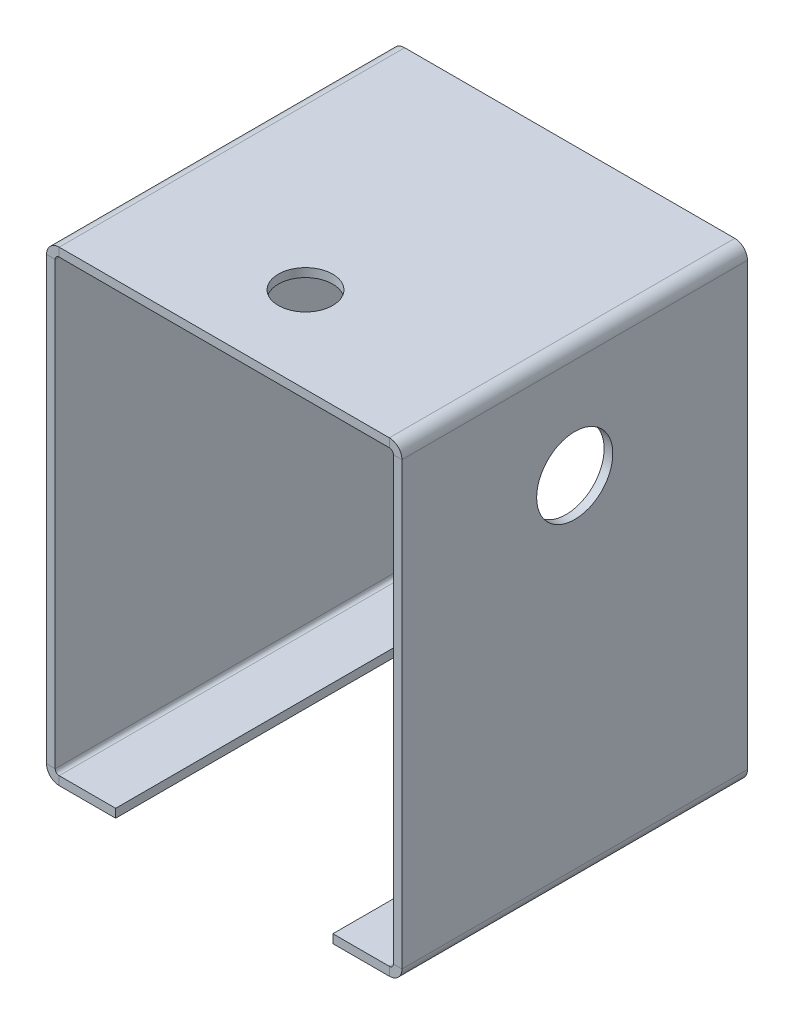
ISO-10303-21;
HEADER;
FILE_DESCRIPTION(('STEP AP214'),'2;1');
FILE_NAME('part.step','',(''),(''),'','','');
FILE_SCHEMA(('AUTOMOTIVE_DESIGN { 1 0 10303 214 1 1 1 1 }'));
ENDSEC;
DATA;
#1=APPLICATION_CONTEXT('core data for automotive mechanical design processes');
#2=APPLICATION_PROTOCOL_DEFINITION('international standard','automotive_design',2000,#1);
#3=PRODUCT_CONTEXT('',#1,'mechanical');
#4=PRODUCT('Part','Part','',(#3));
#5=PRODUCT_RELATED_PRODUCT_CATEGORY('part','',(#4));
#6=PRODUCT_DEFINITION_FORMATION('','',#4);
#7=PRODUCT_DEFINITION_CONTEXT('part definition',#1,'design');
#8=PRODUCT_DEFINITION('design','',#6,#7);
#9=PRODUCT_DEFINITION_SHAPE('','',#8);
#10=(LENGTH_UNIT() NAMED_UNIT(*) SI_UNIT(.MILLI.,.METRE.));
#11=(NAMED_UNIT(*) PLANE_ANGLE_UNIT() SI_UNIT($,.RADIAN.));
#12=(NAMED_UNIT(*) SI_UNIT($,.STERADIAN.) SOLID_ANGLE_UNIT());
#13=UNCERTAINTY_MEASURE_WITH_UNIT(LENGTH_MEASURE(1.E-05),#10,'distance_accuracy_value','');
#14=(GEOMETRIC_REPRESENTATION_CONTEXT(3) GLOBAL_UNCERTAINTY_ASSIGNED_CONTEXT((#13)) GLOBAL_UNIT_ASSIGNED_CONTEXT((#10,
#11,#12)) REPRESENTATION_CONTEXT('',''));
#15=CARTESIAN_POINT('',(0.,0.,0.));
#16=DIRECTION('',(0.,0.,1.));
#17=DIRECTION('',(1.,0.,0.));
#18=AXIS2_PLACEMENT_3D('',#15,#16,#17);
#19=CARTESIAN_POINT('',(-63.7499999440006,2.19380097704199E-13,0.));
#20=DIRECTION('',(0.,0.,1.));
#21=DIRECTION('',(1.,0.,0.));
#22=AXIS2_PLACEMENT_3D('',#19,#20,#21);
#23=PLANE('',#22);
#24=DIRECTION('',(-1.,0.,0.));
#25=VECTOR('',#24,1.);
#26=CARTESIAN_POINT('',(-62.1624999440006,0.736600000000206,0.));
#27=LINE('',#26,#25);
#28=CARTESIAN_POINT('',(-62.1624999440006,0.736600000000201,0.));
#29=VERTEX_POINT('',#28);
#30=CARTESIAN_POINT('',(-63.7499999440006,0.736600000000207,0.));
#31=VERTEX_POINT('',#30);
#32=EDGE_CURVE('E235',#29,#31,#27,.T.);
#33=ORIENTED_EDGE('',*,*,#32,.T.);
#34=DIRECTION('',(0.,-1.,0.));
#35=VECTOR('',#34,1.);
#36=CARTESIAN_POINT('',(-63.7499999440006,2.19380097704199E-13,0.));
#37=LINE('',#36,#35);
#38=CARTESIAN_POINT('',(-63.749999944,81.8134000000002,0.));
#39=VERTEX_POINT('',#38);
#40=EDGE_CURVE('E258',#39,#31,#37,.T.);
#41=ORIENTED_EDGE('',*,*,#40,.F.);
#42=DIRECTION('',(-1.,0.,0.));
#43=VECTOR('',#42,1.);
#44=CARTESIAN_POINT('',(-62.162499944,81.8134000000002,0.));
#45=LINE('',#44,#43);
#46=CARTESIAN_POINT('',(-62.162499944,81.8134000000002,0.));
#47=VERTEX_POINT('',#46);
#48=EDGE_CURVE('E249',#47,#39,#45,.T.);
#49=ORIENTED_EDGE('',*,*,#48,.F.);
#50=DIRECTION('',(0.,-1.,0.));
#51=VECTOR('',#50,1.);
#52=CARTESIAN_POINT('',(-62.1624999440006,2.08166817117217E-13,0.));
#53=LINE('',#52,#51);
#54=EDGE_CURVE('E257',#47,#29,#53,.T.);
#55=ORIENTED_EDGE('',*,*,#54,.T.);
#56=EDGE_LOOP('',(#33,#41,#49,#55));
#57=FACE_BOUND('',#56,.T.);
#58=ADVANCED_FACE('F38',(#57),#23,.F.);
#59=CARTESIAN_POINT('',(-63.749999944,82.5500000000002,63.5));
#60=DIRECTION('',(0.,0.,-1.));
#61=DIRECTION('',(-1.,0.,0.));
#62=AXIS2_PLACEMENT_3D('',#59,#60,#61);
#63=PLANE('',#62);
#64=DIRECTION('',(-1.,0.,0.));
#65=VECTOR('',#64,1.);
#66=CARTESIAN_POINT('',(-62.1624999440006,0.736600000000197,63.5));
#67=LINE('',#66,#65);
#68=CARTESIAN_POINT('',(-62.1624999440006,0.736600000000197,63.5));
#69=VERTEX_POINT('',#68);
#70=CARTESIAN_POINT('',(-63.7499999440006,0.736600000000208,63.5));
#71=VERTEX_POINT('',#70);
#72=EDGE_CURVE('E241',#69,#71,#67,.T.);
#73=ORIENTED_EDGE('',*,*,#72,.F.);
#74=DIRECTION('',(0.,1.,0.));
#75=VECTOR('',#74,1.);
#76=CARTESIAN_POINT('',(-62.162499944,82.5500000000002,63.5));
#77=LINE('',#76,#75);
#78=CARTESIAN_POINT('',(-62.162499944,81.8134000000002,63.5));
#79=VERTEX_POINT('',#78);
#80=EDGE_CURVE('E261',#69,#79,#77,.T.);
#81=ORIENTED_EDGE('',*,*,#80,.T.);
#82=DIRECTION('',(-1.,0.,0.));
#83=VECTOR('',#82,1.);
#84=CARTESIAN_POINT('',(-62.162499944,81.8134000000002,63.5));
#85=LINE('',#84,#83);
#86=CARTESIAN_POINT('',(-63.749999944,81.8134000000002,63.5));
#87=VERTEX_POINT('',#86);
#88=EDGE_CURVE('E244',#79,#87,#85,.T.);
#89=ORIENTED_EDGE('',*,*,#88,.T.);
#90=DIRECTION('',(0.,1.,0.));
#91=VECTOR('',#90,1.);
#92=CARTESIAN_POINT('',(-63.749999944,82.5500000000002,63.5));
#93=LINE('',#92,#91);
#94=EDGE_CURVE('E260',#71,#87,#93,.T.);
#95=ORIENTED_EDGE('',*,*,#94,.F.);
#96=EDGE_LOOP('',(#73,#81,#89,#95));
#97=FACE_BOUND('',#96,.T.);
#98=ADVANCED_FACE('F457',(#97),#63,.F.);
#99=CARTESIAN_POINT('',(-63.7499999440006,4.50128790225952E-13,0.));
#100=DIRECTION('',(1.,0.,0.));
#101=DIRECTION('',(0.,1.,0.));
#102=AXIS2_PLACEMENT_3D('',#99,#100,#101);
#103=PLANE('',#102);
#104=CARTESIAN_POINT('',(-63.7499999440002,63.4125000000004,31.75));
#105=DIRECTION('',(1.,0.,0.));
#106=DIRECTION('',(0.,1.,0.));
#107=AXIS2_PLACEMENT_3D('',#104,#105,#106);
#108=CIRCLE('',#107,5.);
#109=CARTESIAN_POINT('',(-63.7499999440001,68.4125000000004,31.75));
#110=VERTEX_POINT('',#109);
#111=EDGE_CURVE('E437',#110,#110,#108,.T.);
#112=ORIENTED_EDGE('',*,*,#111,.T.);
#113=EDGE_LOOP('',(#112));
#114=FACE_BOUND('',#113,.T.);
#115=DIRECTION('',(0.,0.,-1.));
#116=VECTOR('',#115,1.);
#117=CARTESIAN_POINT('',(-63.7499999440006,0.736600000000207,0.));
#118=LINE('',#117,#116);
#119=EDGE_CURVE('E188',#31,#71,#118,.F.);
#120=ORIENTED_EDGE('',*,*,#119,.T.);
#121=ORIENTED_EDGE('',*,*,#94,.T.);
#122=DIRECTION('',(0.,0.,1.));
#123=VECTOR('',#122,1.);
#124=CARTESIAN_POINT('',(-63.749999944,81.8134000000002,0.));
#125=LINE('',#124,#123);
#126=EDGE_CURVE('E252',#39,#87,#125,.T.);
#127=ORIENTED_EDGE('',*,*,#126,.F.);
#128=ORIENTED_EDGE('',*,*,#40,.T.);
#129=EDGE_LOOP('',(#120,#121,#127,#128));
#130=FACE_BOUND('',#129,.T.);
#131=ADVANCED_FACE('F449',(#114,#130),#103,.F.);
#132=CARTESIAN_POINT('',(-62.1624999440006,4.3891550963897E-13,0.));
#133=DIRECTION('',(1.,0.,0.));
#134=DIRECTION('',(0.,1.,0.));
#135=AXIS2_PLACEMENT_3D('',#132,#133,#134);
#136=PLANE('',#135);
#137=CARTESIAN_POINT('',(-62.1624999440001,63.4125000000004,31.75));
#138=DIRECTION('',(1.,0.,0.));
#139=DIRECTION('',(0.,1.,0.));
#140=AXIS2_PLACEMENT_3D('',#137,#138,#139);
#141=CIRCLE('',#140,5.);
#142=CARTESIAN_POINT('',(-62.1624999440001,68.4125000000004,31.75));
#143=VERTEX_POINT('',#142);
#144=EDGE_CURVE('E440',#143,#143,#141,.T.);
#145=ORIENTED_EDGE('',*,*,#144,.F.);
#146=EDGE_LOOP('',(#145));
#147=FACE_BOUND('',#146,.T.);
#148=ORIENTED_EDGE('',*,*,#80,.F.);
#149=DIRECTION('',(0.,0.,-1.));
#150=VECTOR('',#149,1.);
#151=CARTESIAN_POINT('',(-62.1624999440006,0.736600000000206,0.));
#152=LINE('',#151,#150);
#153=EDGE_CURVE('E55',#29,#69,#152,.F.);
#154=ORIENTED_EDGE('',*,*,#153,.F.);
#155=ORIENTED_EDGE('',*,*,#54,.F.);
#156=DIRECTION('',(0.,0.,-1.));
#157=VECTOR('',#156,1.);
#158=CARTESIAN_POINT('',(-62.162499944,81.8134000000002,63.5));
#159=LINE('',#158,#157);
#160=EDGE_CURVE('E247',#79,#47,#159,.T.);
#161=ORIENTED_EDGE('',*,*,#160,.F.);
#162=EDGE_LOOP('',(#148,#154,#155,#161));
#163=FACE_BOUND('',#162,.T.);
#164=ADVANCED_FACE('F421',(#147,#163),#136,.T.);
#165=CARTESIAN_POINT('',(0.,84.1375,63.5));
#166=DIRECTION('',(0.,0.,-1.));
#167=DIRECTION('',(-1.,0.,0.));
#168=AXIS2_PLACEMENT_3D('',#165,#166,#167);
#169=PLANE('',#168);
#170=DIRECTION('',(0.,1.,0.));
#171=VECTOR('',#170,1.);
#172=CARTESIAN_POINT('',(-61.425899944,82.5500000000002,63.5));
#173=LINE('',#172,#171);
#174=CARTESIAN_POINT('',(-61.425899944,82.5500000000002,63.5));
#175=VERTEX_POINT('',#174);
#176=CARTESIAN_POINT('',(-61.425899944,84.1375000000002,63.5));
#177=VERTEX_POINT('',#176);
#178=EDGE_CURVE('E281',#175,#177,#173,.T.);
#179=ORIENTED_EDGE('',*,*,#178,.F.);
#180=DIRECTION('',(1.,0.,0.));
#181=VECTOR('',#180,1.);
#182=CARTESIAN_POINT('',(0.,82.55,63.5));
#183=LINE('',#182,#181);
#184=CARTESIAN_POINT('',(-0.736600000000004,82.55,63.5));
#185=VERTEX_POINT('',#184);
#186=EDGE_CURVE('E297',#175,#185,#183,.T.);
#187=ORIENTED_EDGE('',*,*,#186,.T.);
#188=DIRECTION('',(0.,1.,0.));
#189=VECTOR('',#188,1.);
#190=CARTESIAN_POINT('',(-0.736600000000004,82.55,63.5));
#191=LINE('',#190,#189);
#192=CARTESIAN_POINT('',(-0.736599999999998,84.1375,63.5));
#193=VERTEX_POINT('',#192);
#194=EDGE_CURVE('E284',#185,#193,#191,.T.);
#195=ORIENTED_EDGE('',*,*,#194,.T.);
#196=DIRECTION('',(1.,0.,0.));
#197=VECTOR('',#196,1.);
#198=CARTESIAN_POINT('',(0.,84.1375,63.5));
#199=LINE('',#198,#197);
#200=EDGE_CURVE('E298',#177,#193,#199,.T.);
#201=ORIENTED_EDGE('',*,*,#200,.F.);
#202=EDGE_LOOP('',(#179,#187,#195,#201));
#203=FACE_BOUND('',#202,.T.);
#204=ADVANCED_FACE('F448',(#203),#169,.F.);
#205=CARTESIAN_POINT('',(-62.162499944,84.1375000000002,0.));
#206=DIRECTION('',(0.,0.,1.));
#207=DIRECTION('',(1.,0.,0.));
#208=AXIS2_PLACEMENT_3D('',#205,#206,#207);
#209=PLANE('',#208);
#210=DIRECTION('',(0.,1.,0.));
#211=VECTOR('',#210,1.);
#212=CARTESIAN_POINT('',(-61.425899944,82.5500000000002,0.));
#213=LINE('',#212,#211);
#214=CARTESIAN_POINT('',(-61.425899944,82.5500000000002,0.));
#215=VERTEX_POINT('',#214);
#216=CARTESIAN_POINT('',(-61.425899944,84.1375000000002,0.));
#217=VERTEX_POINT('',#216);
#218=EDGE_CURVE('E272',#215,#217,#213,.T.);
#219=ORIENTED_EDGE('',*,*,#218,.T.);
#220=DIRECTION('',(-1.,0.,0.));
#221=VECTOR('',#220,1.);
#222=CARTESIAN_POINT('',(-62.162499944,84.1375000000002,0.));
#223=LINE('',#222,#221);
#224=CARTESIAN_POINT('',(-0.736599999999998,84.1375,0.));
#225=VERTEX_POINT('',#224);
#226=EDGE_CURVE('E300',#225,#217,#223,.T.);
#227=ORIENTED_EDGE('',*,*,#226,.F.);
#228=DIRECTION('',(0.,1.,0.));
#229=VECTOR('',#228,1.);
#230=CARTESIAN_POINT('',(-0.736600000000004,82.55,0.));
#231=LINE('',#230,#229);
#232=CARTESIAN_POINT('',(-0.736600000000004,82.55,0.));
#233=VERTEX_POINT('',#232);
#234=EDGE_CURVE('E289',#233,#225,#231,.T.);
#235=ORIENTED_EDGE('',*,*,#234,.F.);
#236=DIRECTION('',(-1.,0.,0.));
#237=VECTOR('',#236,1.);
#238=CARTESIAN_POINT('',(-62.162499944,82.5500000000002,0.));
#239=LINE('',#238,#237);
#240=EDGE_CURVE('E301',#233,#215,#239,.T.);
#241=ORIENTED_EDGE('',*,*,#240,.T.);
#242=EDGE_LOOP('',(#219,#227,#235,#241));
#243=FACE_BOUND('',#242,.T.);
#244=ADVANCED_FACE('F410',(#243),#209,.F.);
#245=CARTESIAN_POINT('',(3.00411532627006E-13,84.1375,0.));
#246=DIRECTION('',(0.,-1.,0.));
#247=DIRECTION('',(1.,0.,0.));
#248=AXIS2_PLACEMENT_3D('',#245,#246,#247);
#249=PLANE('',#248);
#250=CARTESIAN_POINT('',(-32.,84.1375000000001,47.64999995));
#251=DIRECTION('',(0.,1.,0.));
#252=DIRECTION('',(-1.,0.,0.));
#253=AXIS2_PLACEMENT_3D('',#250,#251,#252);
#254=CIRCLE('',#253,5.);
#255=CARTESIAN_POINT('',(-37.,84.1375000000001,47.64999995));
#256=VERTEX_POINT('',#255);
#257=EDGE_CURVE('E434',#256,#256,#254,.T.);
#258=ORIENTED_EDGE('',*,*,#257,.F.);
#259=EDGE_LOOP('',(#258));
#260=FACE_BOUND('',#259,.T.);
#261=DIRECTION('',(0.,0.,-1.));
#262=VECTOR('',#261,1.);
#263=CARTESIAN_POINT('',(-61.425899944,84.1375000000002,0.));
#264=LINE('',#263,#262);
#265=EDGE_CURVE('E266',#217,#177,#264,.F.);
#266=ORIENTED_EDGE('',*,*,#265,.T.);
#267=ORIENTED_EDGE('',*,*,#200,.T.);
#268=DIRECTION('',(0.,0.,1.));
#269=VECTOR('',#268,1.);
#270=CARTESIAN_POINT('',(-0.736599999999998,84.1375,0.));
#271=LINE('',#270,#269);
#272=EDGE_CURVE('E292',#225,#193,#271,.T.);
#273=ORIENTED_EDGE('',*,*,#272,.F.);
#274=ORIENTED_EDGE('',*,*,#226,.T.);
#275=EDGE_LOOP('',(#266,#267,#273,#274));
#276=FACE_BOUND('',#275,.T.);
#277=ADVANCED_FACE('F481',(#260,#276),#249,.F.);
#278=CARTESIAN_POINT('',(2.94868806001592E-13,82.55,0.));
#279=DIRECTION('',(0.,-1.,0.));
#280=DIRECTION('',(1.,0.,0.));
#281=AXIS2_PLACEMENT_3D('',#278,#279,#280);
#282=PLANE('',#281);
#283=CARTESIAN_POINT('',(-32.,82.5500000000001,47.64999995));
#284=DIRECTION('',(0.,-1.,0.));
#285=DIRECTION('',(1.,0.,0.));
#286=AXIS2_PLACEMENT_3D('',#283,#284,#285);
#287=CIRCLE('',#286,5.);
#288=CARTESIAN_POINT('',(-27.,82.5500000000001,47.64999995));
#289=VERTEX_POINT('',#288);
#290=EDGE_CURVE('E42',#289,#289,#287,.T.);
#291=ORIENTED_EDGE('',*,*,#290,.F.);
#292=EDGE_LOOP('',(#291));
#293=FACE_BOUND('',#292,.T.);
#294=ORIENTED_EDGE('',*,*,#186,.F.);
#295=DIRECTION('',(0.,0.,-1.));
#296=VECTOR('',#295,1.);
#297=CARTESIAN_POINT('',(-61.425899944,82.5500000000002,0.));
#298=LINE('',#297,#296);
#299=EDGE_CURVE('E63',#215,#175,#298,.F.);
#300=ORIENTED_EDGE('',*,*,#299,.F.);
#301=ORIENTED_EDGE('',*,*,#240,.F.);
#302=DIRECTION('',(0.,0.,-1.));
#303=VECTOR('',#302,1.);
#304=CARTESIAN_POINT('',(-0.736600000000004,82.55,63.5));
#305=LINE('',#304,#303);
#306=EDGE_CURVE('E287',#185,#233,#305,.T.);
#307=ORIENTED_EDGE('',*,*,#306,.F.);
#308=EDGE_LOOP('',(#294,#300,#301,#307));
#309=FACE_BOUND('',#308,.T.);
#310=ADVANCED_FACE('F407',(#293,#309),#282,.T.);
#311=CARTESIAN_POINT('',(1.5875,0.,63.5));
#312=DIRECTION('',(-1.,0.,0.));
#313=DIRECTION('',(0.,0.,1.));
#314=AXIS2_PLACEMENT_3D('',#311,#312,#313);
#315=PLANE('',#314);
#316=CARTESIAN_POINT('',(1.5875,63.4125,31.75));
#317=DIRECTION('',(-1.,0.,0.));
#318=DIRECTION('',(0.,0.,1.));
#319=AXIS2_PLACEMENT_3D('',#316,#317,#318);
#320=CIRCLE('',#319,7.);
#321=CARTESIAN_POINT('',(1.5875,63.4125,38.75));
#322=VERTEX_POINT('',#321);
#323=EDGE_CURVE('E329',#322,#322,#320,.T.);
#324=ORIENTED_EDGE('',*,*,#323,.T.);
#325=EDGE_LOOP('',(#324));
#326=FACE_BOUND('',#325,.T.);
#327=DIRECTION('',(0.,0.,-1.));
#328=VECTOR('',#327,1.);
#329=CARTESIAN_POINT('',(1.5875,81.8134,0.));
#330=LINE('',#329,#328);
#331=CARTESIAN_POINT('',(1.5875,81.8134,0.));
#332=VERTEX_POINT('',#331);
#333=CARTESIAN_POINT('',(1.5875,81.8134,63.5));
#334=VERTEX_POINT('',#333);
#335=EDGE_CURVE('E306',#332,#334,#330,.F.);
#336=ORIENTED_EDGE('',*,*,#335,.T.);
#337=DIRECTION('',(0.,1.,0.));
#338=VECTOR('',#337,1.);
#339=CARTESIAN_POINT('',(1.5875,0.,63.5));
#340=LINE('',#339,#338);
#341=CARTESIAN_POINT('',(1.5875,0.736599999999993,63.5));
#342=VERTEX_POINT('',#341);
#343=EDGE_CURVE('E47',#342,#334,#340,.T.);
#344=ORIENTED_EDGE('',*,*,#343,.F.);
#345=DIRECTION('',(0.,0.,1.));
#346=VECTOR('',#345,1.);
#347=CARTESIAN_POINT('',(1.5875,0.736599999999993,63.5));
#348=LINE('',#347,#346);
#349=CARTESIAN_POINT('',(1.5875,0.736599999999993,0.));
#350=VERTEX_POINT('',#349);
#351=EDGE_CURVE('E365',#342,#350,#348,.F.);
#352=ORIENTED_EDGE('',*,*,#351,.T.);
#353=DIRECTION('',(0.,1.,0.));
#354=VECTOR('',#353,1.);
#355=CARTESIAN_POINT('',(1.5875,0.,0.));
#356=LINE('',#355,#354);
#357=EDGE_CURVE('E386',#350,#332,#356,.T.);
#358=ORIENTED_EDGE('',*,*,#357,.T.);
#359=EDGE_LOOP('',(#336,#344,#352,#358));
#360=FACE_BOUND('',#359,.T.);
#361=ADVANCED_FACE('F40',(#326,#360),#315,.F.);
#362=CARTESIAN_POINT('',(0.,0.,63.5));
#363=DIRECTION('',(-1.,0.,0.));
#364=DIRECTION('',(0.,0.,1.));
#365=AXIS2_PLACEMENT_3D('',#362,#363,#364);
#366=PLANE('',#365);
#367=CARTESIAN_POINT('',(0.,63.4125,31.75));
#368=DIRECTION('',(-1.,0.,0.));
#369=DIRECTION('',(0.,0.,1.));
#370=AXIS2_PLACEMENT_3D('',#367,#368,#369);
#371=CIRCLE('',#370,7.);
#372=CARTESIAN_POINT('',(0.,63.4125,38.75));
#373=VERTEX_POINT('',#372);
#374=EDGE_CURVE('E326',#373,#373,#371,.T.);
#375=ORIENTED_EDGE('',*,*,#374,.F.);
#376=EDGE_LOOP('',(#375));
#377=FACE_BOUND('',#376,.T.);
#378=DIRECTION('',(0.,1.,0.));
#379=VECTOR('',#378,1.);
#380=CARTESIAN_POINT('',(0.,0.,63.5));
#381=LINE('',#380,#379);
#382=CARTESIAN_POINT('',(0.,0.736599999999997,63.5));
#383=VERTEX_POINT('',#382);
#384=CARTESIAN_POINT('',(0.,81.8134,63.5));
#385=VERTEX_POINT('',#384);
#386=EDGE_CURVE('E11',#383,#385,#381,.T.);
#387=ORIENTED_EDGE('',*,*,#386,.T.);
#388=DIRECTION('',(0.,0.,-1.));
#389=VECTOR('',#388,1.);
#390=CARTESIAN_POINT('',(0.,81.8134,0.));
#391=LINE('',#390,#389);
#392=CARTESIAN_POINT('',(0.,81.8134,0.));
#393=VERTEX_POINT('',#392);
#394=EDGE_CURVE('E318',#393,#385,#391,.F.);
#395=ORIENTED_EDGE('',*,*,#394,.F.);
#396=DIRECTION('',(0.,1.,0.));
#397=VECTOR('',#396,1.);
#398=CARTESIAN_POINT('',(0.,0.,0.));
#399=LINE('',#398,#397);
#400=CARTESIAN_POINT('',(0.,0.736599999999993,0.));
#401=VERTEX_POINT('',#400);
#402=EDGE_CURVE('E390',#401,#393,#399,.T.);
#403=ORIENTED_EDGE('',*,*,#402,.F.);
#404=DIRECTION('',(0.,0.,1.));
#405=VECTOR('',#404,1.);
#406=CARTESIAN_POINT('',(0.,0.736599999999997,63.5));
#407=LINE('',#406,#405);
#408=EDGE_CURVE('E378',#383,#401,#407,.F.);
#409=ORIENTED_EDGE('',*,*,#408,.F.);
#410=EDGE_LOOP('',(#387,#395,#403,#409));
#411=FACE_BOUND('',#410,.T.);
#412=ADVANCED_FACE('F545',(#377,#411),#366,.T.);
#413=CARTESIAN_POINT('',(0.,0.,63.5));
#414=DIRECTION('',(0.,0.,-1.));
#415=DIRECTION('',(-1.,0.,0.));
#416=AXIS2_PLACEMENT_3D('',#413,#414,#415);
#417=PLANE('',#416);
#418=DIRECTION('',(1.,0.,0.));
#419=VECTOR('',#418,1.);
#420=CARTESIAN_POINT('',(0.,81.8134,63.5));
#421=LINE('',#420,#419);
#422=EDGE_CURVE('E323',#385,#334,#421,.T.);
#423=ORIENTED_EDGE('',*,*,#422,.F.);
#424=ORIENTED_EDGE('',*,*,#386,.F.);
#425=DIRECTION('',(1.,0.,0.));
#426=VECTOR('',#425,1.);
#427=CARTESIAN_POINT('',(0.,0.736599999999997,63.5));
#428=LINE('',#427,#426);
#429=EDGE_CURVE('E372',#383,#342,#428,.T.);
#430=ORIENTED_EDGE('',*,*,#429,.T.);
#431=ORIENTED_EDGE('',*,*,#343,.T.);
#432=EDGE_LOOP('',(#423,#424,#430,#431));
#433=FACE_BOUND('',#432,.T.);
#434=ADVANCED_FACE('F542',(#433),#417,.F.);
#435=CARTESIAN_POINT('',(0.,0.,0.));
#436=DIRECTION('',(0.,0.,-1.));
#437=DIRECTION('',(-1.,0.,0.));
#438=AXIS2_PLACEMENT_3D('',#435,#436,#437);
#439=PLANE('',#438);
#440=ORIENTED_EDGE('',*,*,#402,.T.);
#441=DIRECTION('',(1.,0.,0.));
#442=VECTOR('',#441,1.);
#443=CARTESIAN_POINT('',(0.,81.8134,0.));
#444=LINE('',#443,#442);
#445=EDGE_CURVE('E312',#393,#332,#444,.T.);
#446=ORIENTED_EDGE('',*,*,#445,.T.);
#447=ORIENTED_EDGE('',*,*,#357,.F.);
#448=DIRECTION('',(1.,0.,0.));
#449=VECTOR('',#448,1.);
#450=CARTESIAN_POINT('',(0.,0.736599999999993,0.));
#451=LINE('',#450,#449);
#452=EDGE_CURVE('E383',#401,#350,#451,.T.);
#453=ORIENTED_EDGE('',*,*,#452,.F.);
#454=EDGE_LOOP('',(#440,#446,#447,#453));
#455=FACE_BOUND('',#454,.T.);
#456=ADVANCED_FACE('F396',(#455),#439,.T.);
#457=CARTESIAN_POINT('',(-0.7366,0.736599999999995,0.));
#458=DIRECTION('',(0.,0.,-1.));
#459=DIRECTION('',(0.,1.,0.));
#460=AXIS2_PLACEMENT_3D('',#457,#458,#459);
#461=PLANE('',#460);
#462=DIRECTION('',(0.,-1.,0.));
#463=VECTOR('',#462,1.);
#464=CARTESIAN_POINT('',(-0.736599999999997,0.,0.));
#465=LINE('',#464,#463);
#466=CARTESIAN_POINT('',(-0.736599999999997,0.,0.));
#467=VERTEX_POINT('',#466);
#468=CARTESIAN_POINT('',(-0.736599999999992,-1.5875,0.));
#469=VERTEX_POINT('',#468);
#470=EDGE_CURVE('E332',#467,#469,#465,.T.);
#471=ORIENTED_EDGE('',*,*,#470,.F.);
#472=CARTESIAN_POINT('',(-0.7366,0.736599999999995,0.));
#473=DIRECTION('',(0.,0.,1.));
#474=DIRECTION('',(0.,-1.,0.));
#475=AXIS2_PLACEMENT_3D('',#472,#473,#474);
#476=CIRCLE('',#475,0.736599999999998);
#477=EDGE_CURVE('E375',#401,#467,#476,.F.);
#478=ORIENTED_EDGE('',*,*,#477,.F.);
#479=ORIENTED_EDGE('',*,*,#452,.T.);
#480=CARTESIAN_POINT('',(-0.7366,0.736599999999995,0.));
#481=DIRECTION('',(0.,0.,1.));
#482=DIRECTION('',(0.,-1.,0.));
#483=AXIS2_PLACEMENT_3D('',#480,#481,#482);
#484=CIRCLE('',#483,2.3241);
#485=EDGE_CURVE('E368',#350,#469,#484,.F.);
#486=ORIENTED_EDGE('',*,*,#485,.T.);
#487=EDGE_LOOP('',(#471,#478,#479,#486));
#488=FACE_BOUND('',#487,.T.);
#489=ADVANCED_FACE('F535',(#488),#461,.T.);
#490=CARTESIAN_POINT('',(-0.7366,0.7366,63.5));
#491=DIRECTION('',(0.,0.,-1.));
#492=DIRECTION('',(0.,1.,0.));
#493=AXIS2_PLACEMENT_3D('',#490,#491,#492);
#494=PLANE('',#493);
#495=CARTESIAN_POINT('',(-0.7366,0.7366,63.5));
#496=DIRECTION('',(0.,0.,1.));
#497=DIRECTION('',(0.,-1.,0.));
#498=AXIS2_PLACEMENT_3D('',#495,#496,#497);
#499=CIRCLE('',#498,0.736599999999998);
#500=CARTESIAN_POINT('',(-0.736599999999997,0.,63.5));
#501=VERTEX_POINT('',#500);
#502=EDGE_CURVE('E364',#501,#383,#499,.T.);
#503=ORIENTED_EDGE('',*,*,#502,.F.);
#504=DIRECTION('',(0.,-1.,0.));
#505=VECTOR('',#504,1.);
#506=CARTESIAN_POINT('',(-0.736599999999997,0.,63.5));
#507=LINE('',#506,#505);
#508=CARTESIAN_POINT('',(-0.736599999999992,-1.5875,63.5));
#509=VERTEX_POINT('',#508);
#510=EDGE_CURVE('E337',#501,#509,#507,.T.);
#511=ORIENTED_EDGE('',*,*,#510,.T.);
#512=CARTESIAN_POINT('',(-0.7366,0.7366,63.5));
#513=DIRECTION('',(0.,0.,1.));
#514=DIRECTION('',(0.,-1.,0.));
#515=AXIS2_PLACEMENT_3D('',#512,#513,#514);
#516=CIRCLE('',#515,2.3241);
#517=EDGE_CURVE('E369',#509,#342,#516,.T.);
#518=ORIENTED_EDGE('',*,*,#517,.T.);
#519=ORIENTED_EDGE('',*,*,#429,.F.);
#520=EDGE_LOOP('',(#503,#511,#518,#519));
#521=FACE_BOUND('',#520,.T.);
#522=ADVANCED_FACE('F530',(#521),#494,.F.);
#523=CARTESIAN_POINT('',(-0.7366,0.7366,63.5));
#524=DIRECTION('',(0.,0.,1.));
#525=DIRECTION('',(0.,-1.,0.));
#526=AXIS2_PLACEMENT_3D('',#523,#524,#525);
#527=CYLINDRICAL_SURFACE('',#526,2.3241);
#528=ORIENTED_EDGE('',*,*,#351,.F.);
#529=ORIENTED_EDGE('',*,*,#517,.F.);
#530=DIRECTION('',(0.,0.,-1.));
#531=VECTOR('',#530,1.);
#532=CARTESIAN_POINT('',(-0.736599999999992,-1.5875,0.));
#533=LINE('',#532,#531);
#534=EDGE_CURVE('E340',#509,#469,#533,.T.);
#535=ORIENTED_EDGE('',*,*,#534,.T.);
#536=ORIENTED_EDGE('',*,*,#485,.F.);
#537=EDGE_LOOP('',(#528,#529,#535,#536));
#538=FACE_BOUND('',#537,.T.);
#539=ADVANCED_FACE('F527',(#538),#527,.T.);
#540=CARTESIAN_POINT('',(-0.7366,0.7366,63.5));
#541=DIRECTION('',(0.,0.,1.));
#542=DIRECTION('',(0.,-1.,0.));
#543=AXIS2_PLACEMENT_3D('',#540,#541,#542);
#544=CYLINDRICAL_SURFACE('',#543,0.736599999999998);
#545=ORIENTED_EDGE('',*,*,#408,.T.);
#546=ORIENTED_EDGE('',*,*,#477,.T.);
#547=DIRECTION('',(0.,0.,1.));
#548=VECTOR('',#547,1.);
#549=CARTESIAN_POINT('',(-0.736599999999997,0.,0.));
#550=LINE('',#549,#548);
#551=EDGE_CURVE('E335',#467,#501,#550,.T.);
#552=ORIENTED_EDGE('',*,*,#551,.T.);
#553=ORIENTED_EDGE('',*,*,#502,.T.);
#554=EDGE_LOOP('',(#545,#546,#552,#553));
#555=FACE_BOUND('',#554,.T.);
#556=ADVANCED_FACE('F525',(#555),#544,.F.);
#557=CARTESIAN_POINT('',(-11.1125,-1.58750000000004,63.5));
#558=DIRECTION('',(0.,0.,-1.));
#559=DIRECTION('',(-1.,0.,0.));
#560=AXIS2_PLACEMENT_3D('',#557,#558,#559);
#561=PLANE('',#560);
#562=ORIENTED_EDGE('',*,*,#510,.F.);
#563=DIRECTION('',(-1.,0.,0.));
#564=VECTOR('',#563,1.);
#565=CARTESIAN_POINT('',(-11.1125,0.,63.5));
#566=LINE('',#565,#564);
#567=CARTESIAN_POINT('',(-11.1125,0.,63.5));
#568=VERTEX_POINT('',#567);
#569=EDGE_CURVE('E344',#501,#568,#566,.T.);
#570=ORIENTED_EDGE('',*,*,#569,.T.);
#571=DIRECTION('',(0.,1.,0.));
#572=VECTOR('',#571,1.);
#573=CARTESIAN_POINT('',(-11.1125,-1.58750000000004,63.5));
#574=LINE('',#573,#572);
#575=CARTESIAN_POINT('',(-11.1125,-1.58750000000004,63.5));
#576=VERTEX_POINT('',#575);
#577=EDGE_CURVE('E361',#576,#568,#574,.T.);
#578=ORIENTED_EDGE('',*,*,#577,.F.);
#579=DIRECTION('',(-1.,0.,0.));
#580=VECTOR('',#579,1.);
#581=CARTESIAN_POINT('',(-11.1125,-1.58750000000004,63.5));
#582=LINE('',#581,#580);
#583=EDGE_CURVE('E345',#509,#576,#582,.T.);
#584=ORIENTED_EDGE('',*,*,#583,.F.);
#585=EDGE_LOOP('',(#562,#570,#578,#584));
#586=FACE_BOUND('',#585,.T.);
#587=ADVANCED_FACE('F518',(#586),#561,.F.);
#588=CARTESIAN_POINT('',(0.,-1.5875,0.));
#589=DIRECTION('',(0.,0.,1.));
#590=DIRECTION('',(1.,0.,0.));
#591=AXIS2_PLACEMENT_3D('',#588,#589,#590);
#592=PLANE('',#591);
#593=ORIENTED_EDGE('',*,*,#470,.T.);
#594=DIRECTION('',(1.,0.,0.));
#595=VECTOR('',#594,1.);
#596=CARTESIAN_POINT('',(0.,-1.5875,0.));
#597=LINE('',#596,#595);
#598=CARTESIAN_POINT('',(-11.1125,-1.58750000000004,0.));
#599=VERTEX_POINT('',#598);
#600=EDGE_CURVE('E350',#599,#469,#597,.T.);
#601=ORIENTED_EDGE('',*,*,#600,.F.);
#602=DIRECTION('',(0.,1.,0.));
#603=VECTOR('',#602,1.);
#604=CARTESIAN_POINT('',(-11.1125,-1.58750000000004,0.));
#605=LINE('',#604,#603);
#606=CARTESIAN_POINT('',(-11.1125,0.,0.));
#607=VERTEX_POINT('',#606);
#608=EDGE_CURVE('E353',#599,#607,#605,.T.);
#609=ORIENTED_EDGE('',*,*,#608,.T.);
#610=DIRECTION('',(1.,0.,0.));
#611=VECTOR('',#610,1.);
#612=CARTESIAN_POINT('',(0.,0.,0.));
#613=LINE('',#612,#611);
#614=EDGE_CURVE('E348',#607,#467,#613,.T.);
#615=ORIENTED_EDGE('',*,*,#614,.T.);
#616=EDGE_LOOP('',(#593,#601,#609,#615));
#617=FACE_BOUND('',#616,.T.);
#618=ADVANCED_FACE('F511',(#617),#592,.F.);
#619=CARTESIAN_POINT('',(0.,-1.5875,0.));
#620=DIRECTION('',(0.,1.,0.));
#621=DIRECTION('',(-1.,0.,0.));
#622=AXIS2_PLACEMENT_3D('',#619,#620,#621);
#623=PLANE('',#622);
#624=ORIENTED_EDGE('',*,*,#534,.F.);
#625=ORIENTED_EDGE('',*,*,#583,.T.);
#626=DIRECTION('',(0.,0.,-1.));
#627=VECTOR('',#626,1.);
#628=CARTESIAN_POINT('',(-11.1125,-1.58750000000004,0.));
#629=LINE('',#628,#627);
#630=EDGE_CURVE('E347',#576,#599,#629,.T.);
#631=ORIENTED_EDGE('',*,*,#630,.T.);
#632=ORIENTED_EDGE('',*,*,#600,.T.);
#633=EDGE_LOOP('',(#624,#625,#631,#632));
#634=FACE_BOUND('',#633,.T.);
#635=ADVANCED_FACE('F507',(#634),#623,.F.);
#636=CARTESIAN_POINT('',(0.,0.,0.));
#637=DIRECTION('',(0.,1.,0.));
#638=DIRECTION('',(-1.,0.,0.));
#639=AXIS2_PLACEMENT_3D('',#636,#637,#638);
#640=PLANE('',#639);
#641=ORIENTED_EDGE('',*,*,#569,.F.);
#642=ORIENTED_EDGE('',*,*,#551,.F.);
#643=ORIENTED_EDGE('',*,*,#614,.F.);
#644=DIRECTION('',(0.,0.,-1.));
#645=VECTOR('',#644,1.);
#646=CARTESIAN_POINT('',(-11.1125,0.,0.));
#647=LINE('',#646,#645);
#648=EDGE_CURVE('E355',#568,#607,#647,.T.);
#649=ORIENTED_EDGE('',*,*,#648,.F.);
#650=EDGE_LOOP('',(#641,#642,#643,#649));
#651=FACE_BOUND('',#650,.T.);
#652=ADVANCED_FACE('F510',(#651),#640,.T.);
#653=CARTESIAN_POINT('',(-11.1125,-1.58750000000004,0.));
#654=DIRECTION('',(1.,0.,0.));
#655=DIRECTION('',(0.,1.,0.));
#656=AXIS2_PLACEMENT_3D('',#653,#654,#655);
#657=PLANE('',#656);
#658=ORIENTED_EDGE('',*,*,#648,.T.);
#659=ORIENTED_EDGE('',*,*,#608,.F.);
#660=ORIENTED_EDGE('',*,*,#630,.F.);
#661=ORIENTED_EDGE('',*,*,#577,.T.);
#662=EDGE_LOOP('',(#658,#659,#660,#661));
#663=FACE_BOUND('',#662,.T.);
#664=ADVANCED_FACE('F505',(#663),#657,.F.);
#665=CARTESIAN_POINT('',(1.5875,63.4125,31.75));
#666=DIRECTION('',(-1.,0.,0.));
#667=DIRECTION('',(0.,0.,1.));
#668=AXIS2_PLACEMENT_3D('',#665,#666,#667);
#669=CYLINDRICAL_SURFACE('',#668,7.);
#670=ORIENTED_EDGE('',*,*,#323,.F.);
#671=EDGE_LOOP('',(#670));
#672=FACE_BOUND('',#671,.T.);
#673=ORIENTED_EDGE('',*,*,#374,.T.);
#674=EDGE_LOOP('',(#673));
#675=FACE_BOUND('',#674,.T.);
#676=ADVANCED_FACE('F499',(#672,#675),#669,.F.);
#677=CARTESIAN_POINT('',(-0.736600000000006,81.8134,63.5));
#678=DIRECTION('',(0.,0.,1.));
#679=DIRECTION('',(1.,0.,0.));
#680=AXIS2_PLACEMENT_3D('',#677,#678,#679);
#681=PLANE('',#680);
#682=ORIENTED_EDGE('',*,*,#194,.F.);
#683=CARTESIAN_POINT('',(-0.736600000000006,81.8134,63.5));
#684=DIRECTION('',(0.,0.,-1.));
#685=DIRECTION('',(-1.,0.,0.));
#686=AXIS2_PLACEMENT_3D('',#683,#684,#685);
#687=CIRCLE('',#686,0.736600000000004);
#688=EDGE_CURVE('E315',#385,#185,#687,.F.);
#689=ORIENTED_EDGE('',*,*,#688,.F.);
#690=ORIENTED_EDGE('',*,*,#422,.T.);
#691=CARTESIAN_POINT('',(-0.736600000000006,81.8134,63.5));
#692=DIRECTION('',(0.,0.,-1.));
#693=DIRECTION('',(-1.,0.,0.));
#694=AXIS2_PLACEMENT_3D('',#691,#692,#693);
#695=CIRCLE('',#694,2.3241);
#696=EDGE_CURVE('E308',#334,#193,#695,.F.);
#697=ORIENTED_EDGE('',*,*,#696,.T.);
#698=EDGE_LOOP('',(#682,#689,#690,#697));
#699=FACE_BOUND('',#698,.T.);
#700=ADVANCED_FACE('F496',(#699),#681,.T.);
#701=CARTESIAN_POINT('',(-0.736600000000006,81.8134,0.));
#702=DIRECTION('',(0.,0.,1.));
#703=DIRECTION('',(1.,0.,0.));
#704=AXIS2_PLACEMENT_3D('',#701,#702,#703);
#705=PLANE('',#704);
#706=CARTESIAN_POINT('',(-0.736600000000006,81.8134,0.));
#707=DIRECTION('',(0.,0.,-1.));
#708=DIRECTION('',(-1.,0.,0.));
#709=AXIS2_PLACEMENT_3D('',#706,#707,#708);
#710=CIRCLE('',#709,0.736600000000004);
#711=EDGE_CURVE('E303',#233,#393,#710,.T.);
#712=ORIENTED_EDGE('',*,*,#711,.F.);
#713=ORIENTED_EDGE('',*,*,#234,.T.);
#714=CARTESIAN_POINT('',(-0.736600000000006,81.8134,0.));
#715=DIRECTION('',(0.,0.,-1.));
#716=DIRECTION('',(-1.,0.,0.));
#717=AXIS2_PLACEMENT_3D('',#714,#715,#716);
#718=CIRCLE('',#717,2.3241);
#719=EDGE_CURVE('E309',#225,#332,#718,.T.);
#720=ORIENTED_EDGE('',*,*,#719,.T.);
#721=ORIENTED_EDGE('',*,*,#445,.F.);
#722=EDGE_LOOP('',(#712,#713,#720,#721));
#723=FACE_BOUND('',#722,.T.);
#724=ADVANCED_FACE('F401',(#723),#705,.F.);
#725=CARTESIAN_POINT('',(-0.736600000000006,81.8134,0.));
#726=DIRECTION('',(0.,0.,-1.));
#727=DIRECTION('',(0.,1.,0.));
#728=AXIS2_PLACEMENT_3D('',#725,#726,#727);
#729=CYLINDRICAL_SURFACE('',#728,2.3241);
#730=ORIENTED_EDGE('',*,*,#335,.F.);
#731=ORIENTED_EDGE('',*,*,#719,.F.);
#732=ORIENTED_EDGE('',*,*,#272,.T.);
#733=ORIENTED_EDGE('',*,*,#696,.F.);
#734=EDGE_LOOP('',(#730,#731,#732,#733));
#735=FACE_BOUND('',#734,.T.);
#736=ADVANCED_FACE('F490',(#735),#729,.T.);
#737=CARTESIAN_POINT('',(-0.736600000000006,81.8134,0.));
#738=DIRECTION('',(0.,0.,-1.));
#739=DIRECTION('',(0.,1.,0.));
#740=AXIS2_PLACEMENT_3D('',#737,#738,#739);
#741=CYLINDRICAL_SURFACE('',#740,0.736600000000004);
#742=ORIENTED_EDGE('',*,*,#394,.T.);
#743=ORIENTED_EDGE('',*,*,#688,.T.);
#744=ORIENTED_EDGE('',*,*,#306,.T.);
#745=ORIENTED_EDGE('',*,*,#711,.T.);
#746=EDGE_LOOP('',(#742,#743,#744,#745));
#747=FACE_BOUND('',#746,.T.);
#748=ADVANCED_FACE('F404',(#747),#741,.F.);
#749=CARTESIAN_POINT('',(-61.425899944,81.8134000000002,63.5));
#750=DIRECTION('',(0.,0.,1.));
#751=DIRECTION('',(1.,0.,0.));
#752=AXIS2_PLACEMENT_3D('',#749,#750,#751);
#753=PLANE('',#752);
#754=ORIENTED_EDGE('',*,*,#88,.F.);
#755=CARTESIAN_POINT('',(-61.425899944,81.8134000000002,63.5));
#756=DIRECTION('',(0.,0.,-1.));
#757=DIRECTION('',(-1.,0.,0.));
#758=AXIS2_PLACEMENT_3D('',#755,#756,#757);
#759=CIRCLE('',#758,0.736599999999997);
#760=EDGE_CURVE('E275',#175,#79,#759,.F.);
#761=ORIENTED_EDGE('',*,*,#760,.F.);
#762=ORIENTED_EDGE('',*,*,#178,.T.);
#763=CARTESIAN_POINT('',(-61.425899944,81.8134000000002,63.5));
#764=DIRECTION('',(0.,0.,-1.));
#765=DIRECTION('',(-1.,0.,0.));
#766=AXIS2_PLACEMENT_3D('',#763,#764,#765);
#767=CIRCLE('',#766,2.3241);
#768=EDGE_CURVE('E268',#177,#87,#767,.F.);
#769=ORIENTED_EDGE('',*,*,#768,.T.);
#770=EDGE_LOOP('',(#754,#761,#762,#769));
#771=FACE_BOUND('',#770,.T.);
#772=ADVANCED_FACE('F475',(#771),#753,.T.);
#773=CARTESIAN_POINT('',(-61.425899944,81.8134000000002,0.));
#774=DIRECTION('',(0.,0.,1.));
#775=DIRECTION('',(1.,0.,0.));
#776=AXIS2_PLACEMENT_3D('',#773,#774,#775);
#777=PLANE('',#776);
#778=CARTESIAN_POINT('',(-61.425899944,81.8134000000002,0.));
#779=DIRECTION('',(0.,0.,-1.));
#780=DIRECTION('',(-1.,0.,0.));
#781=AXIS2_PLACEMENT_3D('',#778,#779,#780);
#782=CIRCLE('',#781,0.736599999999997);
#783=EDGE_CURVE('E263',#47,#215,#782,.T.);
#784=ORIENTED_EDGE('',*,*,#783,.F.);
#785=ORIENTED_EDGE('',*,*,#48,.T.);
#786=CARTESIAN_POINT('',(-61.425899944,81.8134000000002,0.));
#787=DIRECTION('',(0.,0.,-1.));
#788=DIRECTION('',(-1.,0.,0.));
#789=AXIS2_PLACEMENT_3D('',#786,#787,#788);
#790=CIRCLE('',#789,2.3241);
#791=EDGE_CURVE('E269',#39,#217,#790,.T.);
#792=ORIENTED_EDGE('',*,*,#791,.T.);
#793=ORIENTED_EDGE('',*,*,#218,.F.);
#794=EDGE_LOOP('',(#784,#785,#792,#793));
#795=FACE_BOUND('',#794,.T.);
#796=ADVANCED_FACE('F415',(#795),#777,.F.);
#797=CARTESIAN_POINT('',(-61.425899944,81.8134000000002,0.));
#798=DIRECTION('',(0.,0.,-1.));
#799=DIRECTION('',(-1.,0.,0.));
#800=AXIS2_PLACEMENT_3D('',#797,#798,#799);
#801=CYLINDRICAL_SURFACE('',#800,2.3241);
#802=ORIENTED_EDGE('',*,*,#265,.F.);
#803=ORIENTED_EDGE('',*,*,#791,.F.);
#804=ORIENTED_EDGE('',*,*,#126,.T.);
#805=ORIENTED_EDGE('',*,*,#768,.F.);
#806=EDGE_LOOP('',(#802,#803,#804,#805));
#807=FACE_BOUND('',#806,.T.);
#808=ADVANCED_FACE('F468',(#807),#801,.T.);
#809=CARTESIAN_POINT('',(-61.425899944,81.8134000000002,0.));
#810=DIRECTION('',(0.,0.,-1.));
#811=DIRECTION('',(-1.,0.,0.));
#812=AXIS2_PLACEMENT_3D('',#809,#810,#811);
#813=CYLINDRICAL_SURFACE('',#812,0.736599999999997);
#814=ORIENTED_EDGE('',*,*,#299,.T.);
#815=ORIENTED_EDGE('',*,*,#760,.T.);
#816=ORIENTED_EDGE('',*,*,#160,.T.);
#817=ORIENTED_EDGE('',*,*,#783,.T.);
#818=EDGE_LOOP('',(#814,#815,#816,#817));
#819=FACE_BOUND('',#818,.T.);
#820=ADVANCED_FACE('F418',(#819),#813,.F.);
#821=CARTESIAN_POINT('',(-61.4258999440006,0.736600000000196,63.5));
#822=DIRECTION('',(0.,0.,1.));
#823=DIRECTION('',(0.,-1.,0.));
#824=AXIS2_PLACEMENT_3D('',#821,#822,#823);
#825=PLANE('',#824);
#826=DIRECTION('',(0.,-1.,0.));
#827=VECTOR('',#826,1.);
#828=CARTESIAN_POINT('',(-61.4258999440006,2.0122792321331E-13,63.5));
#829=LINE('',#828,#827);
#830=CARTESIAN_POINT('',(-61.4258999440006,2.00360561475321E-13,63.5));
#831=VERTEX_POINT('',#830);
#832=CARTESIAN_POINT('',(-61.4258999440006,-1.5874999999998,63.5));
#833=VERTEX_POINT('',#832);
#834=EDGE_CURVE('E430',#831,#833,#829,.T.);
#835=ORIENTED_EDGE('',*,*,#834,.F.);
#836=CARTESIAN_POINT('',(-61.4258999440006,0.736600000000196,63.5));
#837=DIRECTION('',(0.,0.,-1.));
#838=DIRECTION('',(0.,1.,0.));
#839=AXIS2_PLACEMENT_3D('',#836,#837,#838);
#840=CIRCLE('',#839,0.736599999999996);
#841=EDGE_CURVE('E191',#69,#831,#840,.F.);
#842=ORIENTED_EDGE('',*,*,#841,.F.);
#843=ORIENTED_EDGE('',*,*,#72,.T.);
#844=CARTESIAN_POINT('',(-61.4258999440006,0.736600000000196,63.5));
#845=DIRECTION('',(0.,0.,-1.));
#846=DIRECTION('',(0.,1.,0.));
#847=AXIS2_PLACEMENT_3D('',#844,#845,#846);
#848=CIRCLE('',#847,2.3241);
#849=EDGE_CURVE('E234',#71,#833,#848,.F.);
#850=ORIENTED_EDGE('',*,*,#849,.T.);
#851=EDGE_LOOP('',(#835,#842,#843,#850));
#852=FACE_BOUND('',#851,.T.);
#853=ADVANCED_FACE('F474',(#852),#825,.T.);
#854=CARTESIAN_POINT('',(-61.4258999440006,0.736600000000205,0.));
#855=DIRECTION('',(0.,0.,1.));
#856=DIRECTION('',(0.,-1.,0.));
#857=AXIS2_PLACEMENT_3D('',#854,#855,#856);
#858=PLANE('',#857);
#859=CARTESIAN_POINT('',(-61.4258999440006,0.736600000000205,0.));
#860=DIRECTION('',(0.,0.,-1.));
#861=DIRECTION('',(0.,1.,0.));
#862=AXIS2_PLACEMENT_3D('',#859,#860,#861);
#863=CIRCLE('',#862,0.736599999999996);
#864=CARTESIAN_POINT('',(-61.4258999440006,2.09684700158697E-13,0.));
#865=VERTEX_POINT('',#864);
#866=EDGE_CURVE('E198',#865,#29,#863,.T.);
#867=ORIENTED_EDGE('',*,*,#866,.F.);
#868=DIRECTION('',(0.,-1.,0.));
#869=VECTOR('',#868,1.);
#870=CARTESIAN_POINT('',(-61.4258999440006,2.0122792321331E-13,0.));
#871=LINE('',#870,#869);
#872=CARTESIAN_POINT('',(-61.4258999440006,-1.5874999999998,0.));
#873=VERTEX_POINT('',#872);
#874=EDGE_CURVE('E195',#865,#873,#871,.T.);
#875=ORIENTED_EDGE('',*,*,#874,.T.);
#876=CARTESIAN_POINT('',(-61.4258999440006,0.736600000000205,0.));
#877=DIRECTION('',(0.,0.,-1.));
#878=DIRECTION('',(0.,1.,0.));
#879=AXIS2_PLACEMENT_3D('',#876,#877,#878);
#880=CIRCLE('',#879,2.3241);
#881=EDGE_CURVE('E181',#873,#31,#880,.T.);
#882=ORIENTED_EDGE('',*,*,#881,.T.);
#883=ORIENTED_EDGE('',*,*,#32,.F.);
#884=EDGE_LOOP('',(#867,#875,#882,#883));
#885=FACE_BOUND('',#884,.T.);
#886=ADVANCED_FACE('F196',(#885),#858,.F.);
#887=CARTESIAN_POINT('',(-61.4258999440006,0.736600000000205,0.));
#888=DIRECTION('',(0.,0.,-1.));
#889=DIRECTION('',(0.,-1.,0.));
#890=AXIS2_PLACEMENT_3D('',#887,#888,#889);
#891=CYLINDRICAL_SURFACE('',#890,2.3241);
#892=ORIENTED_EDGE('',*,*,#119,.F.);
#893=ORIENTED_EDGE('',*,*,#881,.F.);
#894=DIRECTION('',(0.,0.,1.));
#895=VECTOR('',#894,1.);
#896=CARTESIAN_POINT('',(-61.4258999440006,-1.5874999999998,0.));
#897=LINE('',#896,#895);
#898=EDGE_CURVE('E186',#873,#833,#897,.T.);
#899=ORIENTED_EDGE('',*,*,#898,.T.);
#900=ORIENTED_EDGE('',*,*,#849,.F.);
#901=EDGE_LOOP('',(#892,#893,#899,#900));
#902=FACE_BOUND('',#901,.T.);
#903=ADVANCED_FACE('F183',(#902),#891,.T.);
#904=CARTESIAN_POINT('',(-61.4258999440006,0.736600000000205,0.));
#905=DIRECTION('',(0.,0.,-1.));
#906=DIRECTION('',(0.,-1.,0.));
#907=AXIS2_PLACEMENT_3D('',#904,#905,#906);
#908=CYLINDRICAL_SURFACE('',#907,0.736599999999996);
#909=ORIENTED_EDGE('',*,*,#153,.T.);
#910=ORIENTED_EDGE('',*,*,#841,.T.);
#911=DIRECTION('',(0.,0.,-1.));
#912=VECTOR('',#911,1.);
#913=CARTESIAN_POINT('',(-61.4258999440006,2.0122792321331E-13,63.5));
#914=LINE('',#913,#912);
#915=EDGE_CURVE('E202',#831,#865,#914,.T.);
#916=ORIENTED_EDGE('',*,*,#915,.T.);
#917=ORIENTED_EDGE('',*,*,#866,.T.);
#918=EDGE_LOOP('',(#909,#910,#916,#917));
#919=FACE_BOUND('',#918,.T.);
#920=ADVANCED_FACE('F425',(#919),#908,.F.);
#921=CARTESIAN_POINT('',(-51.0499999440006,-1.58749999999991,0.));
#922=DIRECTION('',(0.,0.,1.));
#923=DIRECTION('',(1.,0.,0.));
#924=AXIS2_PLACEMENT_3D('',#921,#922,#923);
#925=PLANE('',#924);
#926=ORIENTED_EDGE('',*,*,#874,.F.);
#927=DIRECTION('',(1.,0.,0.));
#928=VECTOR('',#927,1.);
#929=CARTESIAN_POINT('',(-51.0499999440006,0.,0.));
#930=LINE('',#929,#928);
#931=CARTESIAN_POINT('',(-51.0499999440006,0.,0.));
#932=VERTEX_POINT('',#931);
#933=EDGE_CURVE('E211',#865,#932,#930,.T.);
#934=ORIENTED_EDGE('',*,*,#933,.T.);
#935=DIRECTION('',(0.,1.,0.));
#936=VECTOR('',#935,1.);
#937=CARTESIAN_POINT('',(-51.0499999440006,-1.58749999999991,0.));
#938=LINE('',#937,#936);
#939=CARTESIAN_POINT('',(-51.0499999440006,-1.58749999999991,0.));
#940=VERTEX_POINT('',#939);
#941=EDGE_CURVE('E216',#940,#932,#938,.T.);
#942=ORIENTED_EDGE('',*,*,#941,.F.);
#943=DIRECTION('',(1.,0.,0.));
#944=VECTOR('',#943,1.);
#945=CARTESIAN_POINT('',(-51.0499999440006,-1.58749999999991,0.));
#946=LINE('',#945,#944);
#947=EDGE_CURVE('E207',#873,#940,#946,.T.);
#948=ORIENTED_EDGE('',*,*,#947,.F.);
#949=EDGE_LOOP('',(#926,#934,#942,#948));
#950=FACE_BOUND('',#949,.T.);
#951=ADVANCED_FACE('F214',(#950),#925,.F.);
#952=CARTESIAN_POINT('',(-62.1624999440006,-1.58749999999979,63.5));
#953=DIRECTION('',(0.,0.,-1.));
#954=DIRECTION('',(-1.,0.,0.));
#955=AXIS2_PLACEMENT_3D('',#952,#953,#954);
#956=PLANE('',#955);
#957=ORIENTED_EDGE('',*,*,#834,.T.);
#958=DIRECTION('',(-1.,0.,0.));
#959=VECTOR('',#958,1.);
#960=CARTESIAN_POINT('',(-62.1624999440006,-1.58749999999979,63.5));
#961=LINE('',#960,#959);
#962=CARTESIAN_POINT('',(-51.0499999440006,-1.58749999999991,63.5));
#963=VERTEX_POINT('',#962);
#964=EDGE_CURVE('E210',#963,#833,#961,.T.);
#965=ORIENTED_EDGE('',*,*,#964,.F.);
#966=DIRECTION('',(0.,1.,0.));
#967=VECTOR('',#966,1.);
#968=CARTESIAN_POINT('',(-51.0499999440006,-1.58749999999991,63.5));
#969=LINE('',#968,#967);
#970=CARTESIAN_POINT('',(-51.0499999440006,0.,63.5));
#971=VERTEX_POINT('',#970);
#972=EDGE_CURVE('E227',#963,#971,#969,.T.);
#973=ORIENTED_EDGE('',*,*,#972,.T.);
#974=DIRECTION('',(-1.,0.,0.));
#975=VECTOR('',#974,1.);
#976=CARTESIAN_POINT('',(-62.1624999440006,2.08166817117217E-13,63.5));
#977=LINE('',#976,#975);
#978=EDGE_CURVE('E218',#971,#831,#977,.T.);
#979=ORIENTED_EDGE('',*,*,#978,.T.);
#980=EDGE_LOOP('',(#957,#965,#973,#979));
#981=FACE_BOUND('',#980,.T.);
#982=ADVANCED_FACE('F585',(#981),#956,.F.);
#983=CARTESIAN_POINT('',(0.,-1.58750000000045,0.));
#984=DIRECTION('',(0.,1.,0.));
#985=DIRECTION('',(-1.,0.,0.));
#986=AXIS2_PLACEMENT_3D('',#983,#984,#985);
#987=PLANE('',#986);
#988=ORIENTED_EDGE('',*,*,#898,.F.);
#989=ORIENTED_EDGE('',*,*,#947,.T.);
#990=DIRECTION('',(0.,0.,1.));
#991=VECTOR('',#990,1.);
#992=CARTESIAN_POINT('',(-51.0499999440006,-1.58749999999991,63.5));
#993=LINE('',#992,#991);
#994=EDGE_CURVE('E217',#940,#963,#993,.T.);
#995=ORIENTED_EDGE('',*,*,#994,.T.);
#996=ORIENTED_EDGE('',*,*,#964,.T.);
#997=EDGE_LOOP('',(#988,#989,#995,#996));
#998=FACE_BOUND('',#997,.T.);
#999=ADVANCED_FACE('F206',(#998),#987,.F.);
#1000=CARTESIAN_POINT('',(0.,-4.47787901052069E-13,0.));
#1001=DIRECTION('',(0.,1.,0.));
#1002=DIRECTION('',(-1.,0.,0.));
#1003=AXIS2_PLACEMENT_3D('',#1000,#1001,#1002);
#1004=PLANE('',#1003);
#1005=ORIENTED_EDGE('',*,*,#933,.F.);
#1006=ORIENTED_EDGE('',*,*,#915,.F.);
#1007=ORIENTED_EDGE('',*,*,#978,.F.);
#1008=DIRECTION('',(0.,0.,1.));
#1009=VECTOR('',#1008,1.);
#1010=CARTESIAN_POINT('',(-51.0499999440006,0.,63.5));
#1011=LINE('',#1010,#1009);
#1012=EDGE_CURVE('E222',#932,#971,#1011,.T.);
#1013=ORIENTED_EDGE('',*,*,#1012,.F.);
#1014=EDGE_LOOP('',(#1005,#1006,#1007,#1013));
#1015=FACE_BOUND('',#1014,.T.);
#1016=ADVANCED_FACE('F588',(#1015),#1004,.T.);
#1017=CARTESIAN_POINT('',(-51.0499999440006,-1.58749999999991,63.5));
#1018=DIRECTION('',(-1.,0.,0.));
#1019=DIRECTION('',(0.,-1.,0.));
#1020=AXIS2_PLACEMENT_3D('',#1017,#1018,#1019);
#1021=PLANE('',#1020);
#1022=ORIENTED_EDGE('',*,*,#1012,.T.);
#1023=ORIENTED_EDGE('',*,*,#972,.F.);
#1024=ORIENTED_EDGE('',*,*,#994,.F.);
#1025=ORIENTED_EDGE('',*,*,#941,.T.);
#1026=EDGE_LOOP('',(#1022,#1023,#1024,#1025));
#1027=FACE_BOUND('',#1026,.T.);
#1028=ADVANCED_FACE('F590',(#1027),#1021,.F.);
#1029=CARTESIAN_POINT('',(-32.0000000000003,-1.58750000000014,47.64999995));
#1030=DIRECTION('',(0.,1.,0.));
#1031=DIRECTION('',(-1.,0.,0.));
#1032=AXIS2_PLACEMENT_3D('',#1029,#1030,#1031);
#1033=CYLINDRICAL_SURFACE('',#1032,5.);
#1034=ORIENTED_EDGE('',*,*,#290,.T.);
#1035=EDGE_LOOP('',(#1034));
#1036=FACE_BOUND('',#1035,.T.);
#1037=ORIENTED_EDGE('',*,*,#257,.T.);
#1038=EDGE_LOOP('',(#1037));
#1039=FACE_BOUND('',#1038,.T.);
#1040=ADVANCED_FACE('F592',(#1036,#1039),#1033,.F.);
#1041=CARTESIAN_POINT('',(-71.8144999440001,63.4125000000005,31.75));
#1042=DIRECTION('',(1.,0.,0.));
#1043=DIRECTION('',(0.,1.,0.));
#1044=AXIS2_PLACEMENT_3D('',#1041,#1042,#1043);
#1045=CYLINDRICAL_SURFACE('',#1044,5.);
#1046=ORIENTED_EDGE('',*,*,#144,.T.);
#1047=EDGE_LOOP('',(#1046));
#1048=FACE_BOUND('',#1047,.T.);
#1049=ORIENTED_EDGE('',*,*,#111,.F.);
#1050=EDGE_LOOP('',(#1049));
#1051=FACE_BOUND('',#1050,.T.);
#1052=ADVANCED_FACE('F444',(#1048,#1051),#1045,.F.);
#1053=CLOSED_SHELL('',(#58,#98,#131,#164,#204,#244,#277,#310,#361,#412,#434,#456,#489,#522,#539,
#556,#587,#618,#635,#652,#664,#676,#700,#724,#736,#748,#772,#796,#808,#820,#853,#886,#903,#920,
#951,#982,#999,#1016,#1028,#1040,#1052));
#1054=MANIFOLD_SOLID_BREP('B2',#1053);
#1055=ADVANCED_BREP_SHAPE_REPRESENTATION('',(#18,#1054),#14);
#1056=SHAPE_DEFINITION_REPRESENTATION(#9,#1055);
ENDSEC;
END-ISO-10303-21;
